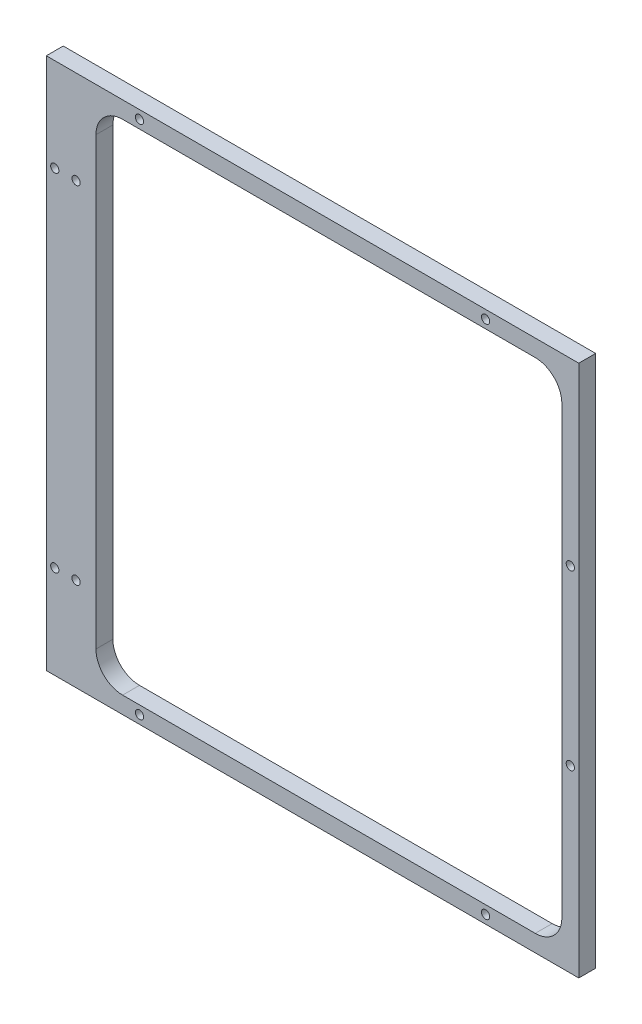
ISO-10303-21;
HEADER;
FILE_DESCRIPTION(('STEP AP214'),'2;1');
FILE_NAME('part.step','',(''),(''),'','','');
FILE_SCHEMA(('AUTOMOTIVE_DESIGN { 1 0 10303 214 1 1 1 1 }'));
ENDSEC;
DATA;
#1=APPLICATION_CONTEXT('core data for automotive mechanical design processes');
#2=APPLICATION_PROTOCOL_DEFINITION('international standard','automotive_design',2000,#1);
#3=PRODUCT_CONTEXT('',#1,'mechanical');
#4=PRODUCT('Part','Part','',(#3));
#5=PRODUCT_RELATED_PRODUCT_CATEGORY('part','',(#4));
#6=PRODUCT_DEFINITION_FORMATION('','',#4);
#7=PRODUCT_DEFINITION_CONTEXT('part definition',#1,'design');
#8=PRODUCT_DEFINITION('design','',#6,#7);
#9=PRODUCT_DEFINITION_SHAPE('','',#8);
#10=(LENGTH_UNIT() NAMED_UNIT(*) SI_UNIT(.MILLI.,.METRE.));
#11=(NAMED_UNIT(*) PLANE_ANGLE_UNIT() SI_UNIT($,.RADIAN.));
#12=(NAMED_UNIT(*) SI_UNIT($,.STERADIAN.) SOLID_ANGLE_UNIT());
#13=UNCERTAINTY_MEASURE_WITH_UNIT(LENGTH_MEASURE(1.E-05),#10,'distance_accuracy_value','');
#14=(GEOMETRIC_REPRESENTATION_CONTEXT(3) GLOBAL_UNCERTAINTY_ASSIGNED_CONTEXT((#13)) GLOBAL_UNIT_ASSIGNED_CONTEXT((#10,
#11,#12)) REPRESENTATION_CONTEXT('',''));
#15=CARTESIAN_POINT('',(0.,0.,0.));
#16=DIRECTION('',(0.,0.,1.));
#17=DIRECTION('',(1.,0.,0.));
#18=AXIS2_PLACEMENT_3D('',#15,#16,#17);
#19=CARTESIAN_POINT('',(100.,-100.,6.35));
#20=DIRECTION('',(-1.,0.,0.));
#21=DIRECTION('',(0.,0.,1.));
#22=AXIS2_PLACEMENT_3D('',#19,#20,#21);
#23=PLANE('',#22);
#24=DIRECTION('',(0.,1.,0.));
#25=VECTOR('',#24,1.);
#26=CARTESIAN_POINT('',(100.,-100.,0.));
#27=LINE('',#26,#25);
#28=CARTESIAN_POINT('',(100.,-100.,0.));
#29=VERTEX_POINT('',#28);
#30=CARTESIAN_POINT('',(100.,100.,0.));
#31=VERTEX_POINT('',#30);
#32=EDGE_CURVE('E184',#29,#31,#27,.T.);
#33=ORIENTED_EDGE('',*,*,#32,.T.);
#34=DIRECTION('',(0.,0.,-1.));
#35=VECTOR('',#34,1.);
#36=CARTESIAN_POINT('',(100.,100.,6.35));
#37=LINE('',#36,#35);
#38=CARTESIAN_POINT('',(100.,100.,6.35));
#39=VERTEX_POINT('',#38);
#40=EDGE_CURVE('E11',#39,#31,#37,.T.);
#41=ORIENTED_EDGE('',*,*,#40,.F.);
#42=DIRECTION('',(0.,1.,0.));
#43=VECTOR('',#42,1.);
#44=CARTESIAN_POINT('',(100.,-100.,6.35));
#45=LINE('',#44,#43);
#46=CARTESIAN_POINT('',(100.,-100.,6.35));
#47=VERTEX_POINT('',#46);
#48=EDGE_CURVE('E196',#47,#39,#45,.T.);
#49=ORIENTED_EDGE('',*,*,#48,.F.);
#50=DIRECTION('',(0.,0.,-1.));
#51=VECTOR('',#50,1.);
#52=CARTESIAN_POINT('',(100.,-100.,6.35));
#53=LINE('',#52,#51);
#54=EDGE_CURVE('E206',#47,#29,#53,.T.);
#55=ORIENTED_EDGE('',*,*,#54,.T.);
#56=EDGE_LOOP('',(#33,#41,#49,#55));
#57=FACE_BOUND('',#56,.T.);
#58=ADVANCED_FACE('F36',(#57),#23,.F.);
#59=CARTESIAN_POINT('',(-100.,100.,6.35));
#60=DIRECTION('',(0.,-1.,0.));
#61=DIRECTION('',(0.,0.,-1.));
#62=AXIS2_PLACEMENT_3D('',#59,#60,#61);
#63=PLANE('',#62);
#64=DIRECTION('',(-1.,0.,0.));
#65=VECTOR('',#64,1.);
#66=CARTESIAN_POINT('',(-100.,100.,0.));
#67=LINE('',#66,#65);
#68=CARTESIAN_POINT('',(-100.,100.,0.));
#69=VERTEX_POINT('',#68);
#70=EDGE_CURVE('E209',#31,#69,#67,.T.);
#71=ORIENTED_EDGE('',*,*,#70,.T.);
#72=DIRECTION('',(0.,0.,-1.));
#73=VECTOR('',#72,1.);
#74=CARTESIAN_POINT('',(-100.,100.,6.35));
#75=LINE('',#74,#73);
#76=CARTESIAN_POINT('',(-100.,100.,6.35));
#77=VERTEX_POINT('',#76);
#78=EDGE_CURVE('E43',#77,#69,#75,.T.);
#79=ORIENTED_EDGE('',*,*,#78,.F.);
#80=DIRECTION('',(-1.,0.,0.));
#81=VECTOR('',#80,1.);
#82=CARTESIAN_POINT('',(-100.,100.,6.35));
#83=LINE('',#82,#81);
#84=EDGE_CURVE('E199',#39,#77,#83,.T.);
#85=ORIENTED_EDGE('',*,*,#84,.F.);
#86=ORIENTED_EDGE('',*,*,#40,.T.);
#87=EDGE_LOOP('',(#71,#79,#85,#86));
#88=FACE_BOUND('',#87,.T.);
#89=ADVANCED_FACE('F237',(#88),#63,.F.);
#90=CARTESIAN_POINT('',(-100.,-100.,6.35));
#91=DIRECTION('',(1.,0.,0.));
#92=DIRECTION('',(0.,0.,-1.));
#93=AXIS2_PLACEMENT_3D('',#90,#91,#92);
#94=PLANE('',#93);
#95=DIRECTION('',(0.,-1.,0.));
#96=VECTOR('',#95,1.);
#97=CARTESIAN_POINT('',(-100.,-100.,0.));
#98=LINE('',#97,#96);
#99=CARTESIAN_POINT('',(-100.,-100.,0.));
#100=VERTEX_POINT('',#99);
#101=EDGE_CURVE('E211',#69,#100,#98,.T.);
#102=ORIENTED_EDGE('',*,*,#101,.T.);
#103=DIRECTION('',(0.,0.,-1.));
#104=VECTOR('',#103,1.);
#105=CARTESIAN_POINT('',(-100.,-100.,6.35));
#106=LINE('',#105,#104);
#107=CARTESIAN_POINT('',(-100.,-100.,6.35));
#108=VERTEX_POINT('',#107);
#109=EDGE_CURVE('E216',#108,#100,#106,.T.);
#110=ORIENTED_EDGE('',*,*,#109,.F.);
#111=DIRECTION('',(0.,-1.,0.));
#112=VECTOR('',#111,1.);
#113=CARTESIAN_POINT('',(-100.,-100.,6.35));
#114=LINE('',#113,#112);
#115=EDGE_CURVE('E202',#77,#108,#114,.T.);
#116=ORIENTED_EDGE('',*,*,#115,.F.);
#117=ORIENTED_EDGE('',*,*,#78,.T.);
#118=EDGE_LOOP('',(#102,#110,#116,#117));
#119=FACE_BOUND('',#118,.T.);
#120=ADVANCED_FACE('F223',(#119),#94,.F.);
#121=CARTESIAN_POINT('',(-100.,-100.,6.35));
#122=DIRECTION('',(0.,1.,0.));
#123=DIRECTION('',(0.,0.,1.));
#124=AXIS2_PLACEMENT_3D('',#121,#122,#123);
#125=PLANE('',#124);
#126=DIRECTION('',(1.,0.,0.));
#127=VECTOR('',#126,1.);
#128=CARTESIAN_POINT('',(-100.,-100.,0.));
#129=LINE('',#128,#127);
#130=EDGE_CURVE('E200',#100,#29,#129,.T.);
#131=ORIENTED_EDGE('',*,*,#130,.T.);
#132=ORIENTED_EDGE('',*,*,#54,.F.);
#133=DIRECTION('',(1.,0.,0.));
#134=VECTOR('',#133,1.);
#135=CARTESIAN_POINT('',(-100.,-100.,6.35));
#136=LINE('',#135,#134);
#137=EDGE_CURVE('E204',#108,#47,#136,.T.);
#138=ORIENTED_EDGE('',*,*,#137,.F.);
#139=ORIENTED_EDGE('',*,*,#109,.T.);
#140=EDGE_LOOP('',(#131,#132,#138,#139));
#141=FACE_BOUND('',#140,.T.);
#142=ADVANCED_FACE('F230',(#141),#125,.F.);
#143=CARTESIAN_POINT('',(0.,0.,6.35));
#144=DIRECTION('',(0.,0.,-1.));
#145=DIRECTION('',(-1.,0.,0.));
#146=AXIS2_PLACEMENT_3D('',#143,#144,#145);
#147=PLANE('',#146);
#148=CARTESIAN_POINT('',(96.825,-32.5,6.35));
#149=DIRECTION('',(0.,0.,1.));
#150=DIRECTION('',(-1.,0.,0.));
#151=AXIS2_PLACEMENT_3D('',#148,#149,#150);
#152=CIRCLE('',#151,1.54999999999999);
#153=CARTESIAN_POINT('',(95.275,-32.5,6.35));
#154=VERTEX_POINT('',#153);
#155=EDGE_CURVE('E345',#154,#154,#152,.T.);
#156=ORIENTED_EDGE('',*,*,#155,.F.);
#157=EDGE_LOOP('',(#156));
#158=FACE_BOUND('',#157,.T.);
#159=CARTESIAN_POINT('',(-96.825,-65.,6.35));
#160=DIRECTION('',(0.,0.,1.));
#161=DIRECTION('',(1.,0.,0.));
#162=AXIS2_PLACEMENT_3D('',#159,#160,#161);
#163=CIRCLE('',#162,1.54999999999999);
#164=CARTESIAN_POINT('',(-95.275,-65.,6.35));
#165=VERTEX_POINT('',#164);
#166=EDGE_CURVE('E341',#165,#165,#163,.T.);
#167=ORIENTED_EDGE('',*,*,#166,.F.);
#168=EDGE_LOOP('',(#167));
#169=FACE_BOUND('',#168,.T.);
#170=CARTESIAN_POINT('',(-88.8249999999999,-65.,6.35));
#171=DIRECTION('',(0.,0.,1.));
#172=DIRECTION('',(-1.,0.,0.));
#173=AXIS2_PLACEMENT_3D('',#170,#171,#172);
#174=CIRCLE('',#173,1.54999999999999);
#175=CARTESIAN_POINT('',(-90.3749999999999,-65.,6.35));
#176=VERTEX_POINT('',#175);
#177=EDGE_CURVE('E336',#176,#176,#174,.T.);
#178=ORIENTED_EDGE('',*,*,#177,.F.);
#179=EDGE_LOOP('',(#178));
#180=FACE_BOUND('',#179,.T.);
#181=CARTESIAN_POINT('',(-96.825,65.,6.35));
#182=DIRECTION('',(0.,0.,1.));
#183=DIRECTION('',(-1.,0.,0.));
#184=AXIS2_PLACEMENT_3D('',#181,#182,#183);
#185=CIRCLE('',#184,1.54999999999999);
#186=CARTESIAN_POINT('',(-98.375,65.,6.35));
#187=VERTEX_POINT('',#186);
#188=EDGE_CURVE('E329',#187,#187,#185,.T.);
#189=ORIENTED_EDGE('',*,*,#188,.F.);
#190=EDGE_LOOP('',(#189));
#191=FACE_BOUND('',#190,.T.);
#192=CARTESIAN_POINT('',(65.,-96.825,6.35));
#193=DIRECTION('',(0.,0.,1.));
#194=DIRECTION('',(-1.,0.,0.));
#195=AXIS2_PLACEMENT_3D('',#192,#193,#194);
#196=CIRCLE('',#195,1.54999999999999);
#197=CARTESIAN_POINT('',(63.45,-96.825,6.35));
#198=VERTEX_POINT('',#197);
#199=EDGE_CURVE('E369',#198,#198,#196,.T.);
#200=ORIENTED_EDGE('',*,*,#199,.F.);
#201=EDGE_LOOP('',(#200));
#202=FACE_BOUND('',#201,.T.);
#203=CARTESIAN_POINT('',(65.,96.825,6.35));
#204=DIRECTION('',(0.,0.,1.));
#205=DIRECTION('',(1.,0.,0.));
#206=AXIS2_PLACEMENT_3D('',#203,#204,#205);
#207=CIRCLE('',#206,1.54999999999999);
#208=CARTESIAN_POINT('',(66.55,96.825,6.35));
#209=VERTEX_POINT('',#208);
#210=EDGE_CURVE('E364',#209,#209,#207,.T.);
#211=ORIENTED_EDGE('',*,*,#210,.F.);
#212=EDGE_LOOP('',(#211));
#213=FACE_BOUND('',#212,.T.);
#214=CARTESIAN_POINT('',(-65.,96.825,6.35));
#215=DIRECTION('',(0.,0.,1.));
#216=DIRECTION('',(-1.,0.,0.));
#217=AXIS2_PLACEMENT_3D('',#214,#215,#216);
#218=CIRCLE('',#217,1.54999999999999);
#219=CARTESIAN_POINT('',(-66.55,96.825,6.35));
#220=VERTEX_POINT('',#219);
#221=EDGE_CURVE('E357',#220,#220,#218,.T.);
#222=ORIENTED_EDGE('',*,*,#221,.F.);
#223=EDGE_LOOP('',(#222));
#224=FACE_BOUND('',#223,.T.);
#225=CARTESIAN_POINT('',(96.825,32.5,6.35));
#226=DIRECTION('',(0.,0.,1.));
#227=DIRECTION('',(1.,0.,0.));
#228=AXIS2_PLACEMENT_3D('',#225,#226,#227);
#229=CIRCLE('',#228,1.54999999999999);
#230=CARTESIAN_POINT('',(98.375,32.5,6.35));
#231=VERTEX_POINT('',#230);
#232=EDGE_CURVE('E352',#231,#231,#229,.T.);
#233=ORIENTED_EDGE('',*,*,#232,.F.);
#234=EDGE_LOOP('',(#233));
#235=FACE_BOUND('',#234,.T.);
#236=CARTESIAN_POINT('',(-88.8249999999999,65.,6.35));
#237=DIRECTION('',(0.,0.,1.));
#238=DIRECTION('',(1.,0.,0.));
#239=AXIS2_PLACEMENT_3D('',#236,#237,#238);
#240=CIRCLE('',#239,1.54999999999999);
#241=CARTESIAN_POINT('',(-87.2749999999999,65.,6.35));
#242=VERTEX_POINT('',#241);
#243=EDGE_CURVE('E324',#242,#242,#240,.T.);
#244=ORIENTED_EDGE('',*,*,#243,.F.);
#245=EDGE_LOOP('',(#244));
#246=FACE_BOUND('',#245,.T.);
#247=CARTESIAN_POINT('',(-65.,-96.825,6.35));
#248=DIRECTION('',(0.,0.,1.));
#249=DIRECTION('',(1.,0.,0.));
#250=AXIS2_PLACEMENT_3D('',#247,#248,#249);
#251=CIRCLE('',#250,1.54999999999999);
#252=CARTESIAN_POINT('',(-63.45,-96.825,6.35));
#253=VERTEX_POINT('',#252);
#254=EDGE_CURVE('E376',#253,#253,#251,.T.);
#255=ORIENTED_EDGE('',*,*,#254,.F.);
#256=EDGE_LOOP('',(#255));
#257=FACE_BOUND('',#256,.T.);
#258=DIRECTION('',(0.,1.,0.));
#259=VECTOR('',#258,1.);
#260=CARTESIAN_POINT('',(93.65,83.65,6.35));
#261=LINE('',#260,#259);
#262=CARTESIAN_POINT('',(93.65,-83.65,6.35));
#263=VERTEX_POINT('',#262);
#264=CARTESIAN_POINT('',(93.65,83.65,6.35));
#265=VERTEX_POINT('',#264);
#266=EDGE_CURVE('E166',#263,#265,#261,.T.);
#267=ORIENTED_EDGE('',*,*,#266,.F.);
#268=CARTESIAN_POINT('',(83.65,-83.65,6.35));
#269=DIRECTION('',(0.,0.,1.));
#270=DIRECTION('',(-1.,0.,0.));
#271=AXIS2_PLACEMENT_3D('',#268,#269,#270);
#272=CIRCLE('',#271,9.99999999999999);
#273=CARTESIAN_POINT('',(83.65,-93.65,6.35));
#274=VERTEX_POINT('',#273);
#275=EDGE_CURVE('E50',#274,#263,#272,.T.);
#276=ORIENTED_EDGE('',*,*,#275,.F.);
#277=DIRECTION('',(1.,0.,0.));
#278=VECTOR('',#277,1.);
#279=CARTESIAN_POINT('',(83.65,-93.65,6.35));
#280=LINE('',#279,#278);
#281=CARTESIAN_POINT('',(-71.35,-93.65,6.35));
#282=VERTEX_POINT('',#281);
#283=EDGE_CURVE('E143',#282,#274,#280,.T.);
#284=ORIENTED_EDGE('',*,*,#283,.F.);
#285=CARTESIAN_POINT('',(-71.35,-83.65,6.35));
#286=DIRECTION('',(0.,0.,1.));
#287=DIRECTION('',(-1.,0.,0.));
#288=AXIS2_PLACEMENT_3D('',#285,#286,#287);
#289=CIRCLE('',#288,10.);
#290=CARTESIAN_POINT('',(-81.35,-83.65,6.35));
#291=VERTEX_POINT('',#290);
#292=EDGE_CURVE('E146',#291,#282,#289,.T.);
#293=ORIENTED_EDGE('',*,*,#292,.F.);
#294=DIRECTION('',(0.,-1.,0.));
#295=VECTOR('',#294,1.);
#296=CARTESIAN_POINT('',(-81.35,83.65,6.35));
#297=LINE('',#296,#295);
#298=CARTESIAN_POINT('',(-81.35,83.65,6.35));
#299=VERTEX_POINT('',#298);
#300=EDGE_CURVE('E177',#299,#291,#297,.T.);
#301=ORIENTED_EDGE('',*,*,#300,.F.);
#302=CARTESIAN_POINT('',(-71.35,83.65,6.35));
#303=DIRECTION('',(0.,0.,1.));
#304=DIRECTION('',(1.,0.,0.));
#305=AXIS2_PLACEMENT_3D('',#302,#303,#304);
#306=CIRCLE('',#305,10.);
#307=CARTESIAN_POINT('',(-71.35,93.65,6.35));
#308=VERTEX_POINT('',#307);
#309=EDGE_CURVE('E174',#308,#299,#306,.T.);
#310=ORIENTED_EDGE('',*,*,#309,.F.);
#311=DIRECTION('',(-1.,0.,0.));
#312=VECTOR('',#311,1.);
#313=CARTESIAN_POINT('',(83.65,93.65,6.35));
#314=LINE('',#313,#312);
#315=CARTESIAN_POINT('',(83.65,93.65,6.35));
#316=VERTEX_POINT('',#315);
#317=EDGE_CURVE('E171',#316,#308,#314,.T.);
#318=ORIENTED_EDGE('',*,*,#317,.F.);
#319=CARTESIAN_POINT('',(83.65,83.65,6.35));
#320=DIRECTION('',(0.,0.,1.));
#321=DIRECTION('',(-1.,0.,0.));
#322=AXIS2_PLACEMENT_3D('',#319,#320,#321);
#323=CIRCLE('',#322,10.);
#324=EDGE_CURVE('E168',#265,#316,#323,.T.);
#325=ORIENTED_EDGE('',*,*,#324,.F.);
#326=EDGE_LOOP('',(#267,#276,#284,#293,#301,#310,#318,#325));
#327=FACE_BOUND('',#326,.T.);
#328=ORIENTED_EDGE('',*,*,#48,.T.);
#329=ORIENTED_EDGE('',*,*,#84,.T.);
#330=ORIENTED_EDGE('',*,*,#115,.T.);
#331=ORIENTED_EDGE('',*,*,#137,.T.);
#332=EDGE_LOOP('',(#328,#329,#330,#331));
#333=FACE_BOUND('',#332,.T.);
#334=ADVANCED_FACE('F236',(#158,#169,#180,#191,#202,#213,#224,#235,#246,#257,#327,#333),#147,.F.);
#335=CARTESIAN_POINT('',(0.,0.,0.));
#336=DIRECTION('',(0.,0.,-1.));
#337=DIRECTION('',(-1.,0.,0.));
#338=AXIS2_PLACEMENT_3D('',#335,#336,#337);
#339=PLANE('',#338);
#340=CARTESIAN_POINT('',(96.825,-32.5,0.));
#341=DIRECTION('',(0.,0.,-1.));
#342=DIRECTION('',(-1.,0.,0.));
#343=AXIS2_PLACEMENT_3D('',#340,#341,#342);
#344=CIRCLE('',#343,1.54999999999999);
#345=CARTESIAN_POINT('',(95.275,-32.5,0.));
#346=VERTEX_POINT('',#345);
#347=EDGE_CURVE('E348',#346,#346,#344,.F.);
#348=ORIENTED_EDGE('',*,*,#347,.T.);
#349=EDGE_LOOP('',(#348));
#350=FACE_BOUND('',#349,.T.);
#351=CARTESIAN_POINT('',(-96.825,-65.,0.));
#352=DIRECTION('',(0.,0.,-1.));
#353=DIRECTION('',(-1.,0.,0.));
#354=AXIS2_PLACEMENT_3D('',#351,#352,#353);
#355=CIRCLE('',#354,1.54999999999999);
#356=CARTESIAN_POINT('',(-98.375,-65.,0.));
#357=VERTEX_POINT('',#356);
#358=EDGE_CURVE('E349',#357,#357,#355,.F.);
#359=ORIENTED_EDGE('',*,*,#358,.T.);
#360=EDGE_LOOP('',(#359));
#361=FACE_BOUND('',#360,.T.);
#362=CARTESIAN_POINT('',(-88.8249999999999,-65.,0.));
#363=DIRECTION('',(0.,0.,-1.));
#364=DIRECTION('',(-1.,0.,0.));
#365=AXIS2_PLACEMENT_3D('',#362,#363,#364);
#366=CIRCLE('',#365,1.54999999999999);
#367=CARTESIAN_POINT('',(-90.3749999999999,-65.,0.));
#368=VERTEX_POINT('',#367);
#369=EDGE_CURVE('E339',#368,#368,#366,.F.);
#370=ORIENTED_EDGE('',*,*,#369,.T.);
#371=EDGE_LOOP('',(#370));
#372=FACE_BOUND('',#371,.T.);
#373=CARTESIAN_POINT('',(-96.825,65.,0.));
#374=DIRECTION('',(0.,0.,-1.));
#375=DIRECTION('',(-1.,0.,0.));
#376=AXIS2_PLACEMENT_3D('',#373,#374,#375);
#377=CIRCLE('',#376,1.54999999999999);
#378=CARTESIAN_POINT('',(-98.375,65.,0.));
#379=VERTEX_POINT('',#378);
#380=EDGE_CURVE('E332',#379,#379,#377,.F.);
#381=ORIENTED_EDGE('',*,*,#380,.T.);
#382=EDGE_LOOP('',(#381));
#383=FACE_BOUND('',#382,.T.);
#384=CARTESIAN_POINT('',(65.,-96.825,0.));
#385=DIRECTION('',(0.,0.,-1.));
#386=DIRECTION('',(-1.,0.,0.));
#387=AXIS2_PLACEMENT_3D('',#384,#385,#386);
#388=CIRCLE('',#387,1.54999999999999);
#389=CARTESIAN_POINT('',(63.45,-96.825,0.));
#390=VERTEX_POINT('',#389);
#391=EDGE_CURVE('E372',#390,#390,#388,.F.);
#392=ORIENTED_EDGE('',*,*,#391,.T.);
#393=EDGE_LOOP('',(#392));
#394=FACE_BOUND('',#393,.T.);
#395=CARTESIAN_POINT('',(65.,96.825,0.));
#396=DIRECTION('',(0.,0.,-1.));
#397=DIRECTION('',(-1.,0.,0.));
#398=AXIS2_PLACEMENT_3D('',#395,#396,#397);
#399=CIRCLE('',#398,1.54999999999999);
#400=CARTESIAN_POINT('',(63.45,96.825,0.));
#401=VERTEX_POINT('',#400);
#402=EDGE_CURVE('E373',#401,#401,#399,.F.);
#403=ORIENTED_EDGE('',*,*,#402,.T.);
#404=EDGE_LOOP('',(#403));
#405=FACE_BOUND('',#404,.T.);
#406=CARTESIAN_POINT('',(-65.,96.825,0.));
#407=DIRECTION('',(0.,0.,-1.));
#408=DIRECTION('',(-1.,0.,0.));
#409=AXIS2_PLACEMENT_3D('',#406,#407,#408);
#410=CIRCLE('',#409,1.54999999999999);
#411=CARTESIAN_POINT('',(-66.55,96.825,0.));
#412=VERTEX_POINT('',#411);
#413=EDGE_CURVE('E360',#412,#412,#410,.F.);
#414=ORIENTED_EDGE('',*,*,#413,.T.);
#415=EDGE_LOOP('',(#414));
#416=FACE_BOUND('',#415,.T.);
#417=CARTESIAN_POINT('',(96.825,32.5,0.));
#418=DIRECTION('',(0.,0.,-1.));
#419=DIRECTION('',(-1.,0.,0.));
#420=AXIS2_PLACEMENT_3D('',#417,#418,#419);
#421=CIRCLE('',#420,1.54999999999999);
#422=CARTESIAN_POINT('',(95.275,32.5,0.));
#423=VERTEX_POINT('',#422);
#424=EDGE_CURVE('E361',#423,#423,#421,.F.);
#425=ORIENTED_EDGE('',*,*,#424,.T.);
#426=EDGE_LOOP('',(#425));
#427=FACE_BOUND('',#426,.T.);
#428=CARTESIAN_POINT('',(-88.8249999999999,65.,0.));
#429=DIRECTION('',(0.,0.,-1.));
#430=DIRECTION('',(-1.,0.,0.));
#431=AXIS2_PLACEMENT_3D('',#428,#429,#430);
#432=CIRCLE('',#431,1.54999999999999);
#433=CARTESIAN_POINT('',(-90.3749999999999,65.,0.));
#434=VERTEX_POINT('',#433);
#435=EDGE_CURVE('E327',#434,#434,#432,.F.);
#436=ORIENTED_EDGE('',*,*,#435,.T.);
#437=EDGE_LOOP('',(#436));
#438=FACE_BOUND('',#437,.T.);
#439=CARTESIAN_POINT('',(-65.,-96.825,0.));
#440=DIRECTION('',(0.,0.,-1.));
#441=DIRECTION('',(-1.,0.,0.));
#442=AXIS2_PLACEMENT_3D('',#439,#440,#441);
#443=CIRCLE('',#442,1.54999999999999);
#444=CARTESIAN_POINT('',(-66.55,-96.825,0.));
#445=VERTEX_POINT('',#444);
#446=EDGE_CURVE('E149',#445,#445,#443,.F.);
#447=ORIENTED_EDGE('',*,*,#446,.T.);
#448=EDGE_LOOP('',(#447));
#449=FACE_BOUND('',#448,.T.);
#450=CARTESIAN_POINT('',(83.65,-83.65,0.));
#451=DIRECTION('',(0.,0.,1.));
#452=DIRECTION('',(-1.,0.,0.));
#453=AXIS2_PLACEMENT_3D('',#450,#451,#452);
#454=CIRCLE('',#453,9.99999999999999);
#455=CARTESIAN_POINT('',(83.65,-93.65,0.));
#456=VERTEX_POINT('',#455);
#457=CARTESIAN_POINT('',(93.65,-83.65,0.));
#458=VERTEX_POINT('',#457);
#459=EDGE_CURVE('E126',#456,#458,#454,.T.);
#460=ORIENTED_EDGE('',*,*,#459,.T.);
#461=DIRECTION('',(0.,1.,0.));
#462=VECTOR('',#461,1.);
#463=CARTESIAN_POINT('',(93.65,83.65,0.));
#464=LINE('',#463,#462);
#465=CARTESIAN_POINT('',(93.65,83.65,0.));
#466=VERTEX_POINT('',#465);
#467=EDGE_CURVE('E135',#458,#466,#464,.T.);
#468=ORIENTED_EDGE('',*,*,#467,.T.);
#469=CARTESIAN_POINT('',(83.65,83.65,0.));
#470=DIRECTION('',(0.,0.,1.));
#471=DIRECTION('',(-1.,0.,0.));
#472=AXIS2_PLACEMENT_3D('',#469,#470,#471);
#473=CIRCLE('',#472,10.);
#474=CARTESIAN_POINT('',(83.65,93.65,0.));
#475=VERTEX_POINT('',#474);
#476=EDGE_CURVE('E58',#466,#475,#473,.T.);
#477=ORIENTED_EDGE('',*,*,#476,.T.);
#478=DIRECTION('',(-1.,0.,0.));
#479=VECTOR('',#478,1.);
#480=CARTESIAN_POINT('',(83.65,93.65,0.));
#481=LINE('',#480,#479);
#482=CARTESIAN_POINT('',(-71.35,93.65,0.));
#483=VERTEX_POINT('',#482);
#484=EDGE_CURVE('E153',#475,#483,#481,.T.);
#485=ORIENTED_EDGE('',*,*,#484,.T.);
#486=CARTESIAN_POINT('',(-71.35,83.65,0.));
#487=DIRECTION('',(0.,0.,1.));
#488=DIRECTION('',(1.,0.,0.));
#489=AXIS2_PLACEMENT_3D('',#486,#487,#488);
#490=CIRCLE('',#489,10.);
#491=CARTESIAN_POINT('',(-81.35,83.65,0.));
#492=VERTEX_POINT('',#491);
#493=EDGE_CURVE('E156',#483,#492,#490,.T.);
#494=ORIENTED_EDGE('',*,*,#493,.T.);
#495=DIRECTION('',(0.,-1.,0.));
#496=VECTOR('',#495,1.);
#497=CARTESIAN_POINT('',(-81.35,83.65,0.));
#498=LINE('',#497,#496);
#499=CARTESIAN_POINT('',(-81.35,-83.65,0.));
#500=VERTEX_POINT('',#499);
#501=EDGE_CURVE('E159',#492,#500,#498,.T.);
#502=ORIENTED_EDGE('',*,*,#501,.T.);
#503=CARTESIAN_POINT('',(-71.35,-83.65,0.));
#504=DIRECTION('',(0.,0.,1.));
#505=DIRECTION('',(-1.,0.,0.));
#506=AXIS2_PLACEMENT_3D('',#503,#504,#505);
#507=CIRCLE('',#506,10.);
#508=CARTESIAN_POINT('',(-71.35,-93.65,0.));
#509=VERTEX_POINT('',#508);
#510=EDGE_CURVE('E162',#500,#509,#507,.T.);
#511=ORIENTED_EDGE('',*,*,#510,.T.);
#512=DIRECTION('',(1.,0.,0.));
#513=VECTOR('',#512,1.);
#514=CARTESIAN_POINT('',(83.65,-93.65,0.));
#515=LINE('',#514,#513);
#516=EDGE_CURVE('E132',#509,#456,#515,.T.);
#517=ORIENTED_EDGE('',*,*,#516,.T.);
#518=EDGE_LOOP('',(#460,#468,#477,#485,#494,#502,#511,#517));
#519=FACE_BOUND('',#518,.T.);
#520=ORIENTED_EDGE('',*,*,#32,.F.);
#521=ORIENTED_EDGE('',*,*,#130,.F.);
#522=ORIENTED_EDGE('',*,*,#101,.F.);
#523=ORIENTED_EDGE('',*,*,#70,.F.);
#524=EDGE_LOOP('',(#520,#521,#522,#523));
#525=FACE_BOUND('',#524,.T.);
#526=ADVANCED_FACE('F139',(#350,#361,#372,#383,#394,#405,#416,#427,#438,#449,#519,#525),#339,.T.);
#527=CARTESIAN_POINT('',(83.65,-83.65,0.));
#528=DIRECTION('',(0.,0.,1.));
#529=DIRECTION('',(1.,0.,0.));
#530=AXIS2_PLACEMENT_3D('',#527,#528,#529);
#531=CYLINDRICAL_SURFACE('',#530,9.99999999999999);
#532=ORIENTED_EDGE('',*,*,#275,.T.);
#533=DIRECTION('',(0.,0.,1.));
#534=VECTOR('',#533,1.);
#535=CARTESIAN_POINT('',(93.65,-83.65,0.));
#536=LINE('',#535,#534);
#537=EDGE_CURVE('E122',#458,#263,#536,.T.);
#538=ORIENTED_EDGE('',*,*,#537,.F.);
#539=ORIENTED_EDGE('',*,*,#459,.F.);
#540=DIRECTION('',(0.,0.,1.));
#541=VECTOR('',#540,1.);
#542=CARTESIAN_POINT('',(83.65,-93.65,0.));
#543=LINE('',#542,#541);
#544=EDGE_CURVE('E182',#456,#274,#543,.T.);
#545=ORIENTED_EDGE('',*,*,#544,.T.);
#546=EDGE_LOOP('',(#532,#538,#539,#545));
#547=FACE_BOUND('',#546,.T.);
#548=ADVANCED_FACE('F124',(#547),#531,.F.);
#549=CARTESIAN_POINT('',(83.65,-93.65,0.));
#550=DIRECTION('',(0.,-1.,0.));
#551=DIRECTION('',(1.,0.,0.));
#552=AXIS2_PLACEMENT_3D('',#549,#550,#551);
#553=PLANE('',#552);
#554=ORIENTED_EDGE('',*,*,#283,.T.);
#555=ORIENTED_EDGE('',*,*,#544,.F.);
#556=ORIENTED_EDGE('',*,*,#516,.F.);
#557=DIRECTION('',(0.,0.,1.));
#558=VECTOR('',#557,1.);
#559=CARTESIAN_POINT('',(-71.35,-93.65,0.));
#560=LINE('',#559,#558);
#561=EDGE_CURVE('E185',#509,#282,#560,.T.);
#562=ORIENTED_EDGE('',*,*,#561,.T.);
#563=EDGE_LOOP('',(#554,#555,#556,#562));
#564=FACE_BOUND('',#563,.T.);
#565=ADVANCED_FACE('F255',(#564),#553,.F.);
#566=CARTESIAN_POINT('',(-71.35,-83.65,0.));
#567=DIRECTION('',(0.,0.,1.));
#568=DIRECTION('',(1.,0.,0.));
#569=AXIS2_PLACEMENT_3D('',#566,#567,#568);
#570=CYLINDRICAL_SURFACE('',#569,10.);
#571=ORIENTED_EDGE('',*,*,#292,.T.);
#572=ORIENTED_EDGE('',*,*,#561,.F.);
#573=ORIENTED_EDGE('',*,*,#510,.F.);
#574=DIRECTION('',(0.,0.,1.));
#575=VECTOR('',#574,1.);
#576=CARTESIAN_POINT('',(-81.35,-83.65,0.));
#577=LINE('',#576,#575);
#578=EDGE_CURVE('E187',#500,#291,#577,.T.);
#579=ORIENTED_EDGE('',*,*,#578,.T.);
#580=EDGE_LOOP('',(#571,#572,#573,#579));
#581=FACE_BOUND('',#580,.T.);
#582=ADVANCED_FACE('F273',(#581),#570,.F.);
#583=CARTESIAN_POINT('',(-81.35,83.65,0.));
#584=DIRECTION('',(-1.,0.,0.));
#585=DIRECTION('',(0.,-1.,0.));
#586=AXIS2_PLACEMENT_3D('',#583,#584,#585);
#587=PLANE('',#586);
#588=ORIENTED_EDGE('',*,*,#300,.T.);
#589=ORIENTED_EDGE('',*,*,#578,.F.);
#590=ORIENTED_EDGE('',*,*,#501,.F.);
#591=DIRECTION('',(0.,0.,1.));
#592=VECTOR('',#591,1.);
#593=CARTESIAN_POINT('',(-81.35,83.65,0.));
#594=LINE('',#593,#592);
#595=EDGE_CURVE('E189',#492,#299,#594,.T.);
#596=ORIENTED_EDGE('',*,*,#595,.T.);
#597=EDGE_LOOP('',(#588,#589,#590,#596));
#598=FACE_BOUND('',#597,.T.);
#599=ADVANCED_FACE('F269',(#598),#587,.F.);
#600=CARTESIAN_POINT('',(-71.35,83.65,0.));
#601=DIRECTION('',(0.,0.,1.));
#602=DIRECTION('',(1.,0.,0.));
#603=AXIS2_PLACEMENT_3D('',#600,#601,#602);
#604=CYLINDRICAL_SURFACE('',#603,10.);
#605=ORIENTED_EDGE('',*,*,#309,.T.);
#606=ORIENTED_EDGE('',*,*,#595,.F.);
#607=ORIENTED_EDGE('',*,*,#493,.F.);
#608=DIRECTION('',(0.,0.,1.));
#609=VECTOR('',#608,1.);
#610=CARTESIAN_POINT('',(-71.35,93.65,0.));
#611=LINE('',#610,#609);
#612=EDGE_CURVE('E191',#483,#308,#611,.T.);
#613=ORIENTED_EDGE('',*,*,#612,.T.);
#614=EDGE_LOOP('',(#605,#606,#607,#613));
#615=FACE_BOUND('',#614,.T.);
#616=ADVANCED_FACE('F265',(#615),#604,.F.);
#617=CARTESIAN_POINT('',(83.65,93.65,0.));
#618=DIRECTION('',(0.,1.,0.));
#619=DIRECTION('',(0.,0.,1.));
#620=AXIS2_PLACEMENT_3D('',#617,#618,#619);
#621=PLANE('',#620);
#622=ORIENTED_EDGE('',*,*,#317,.T.);
#623=ORIENTED_EDGE('',*,*,#612,.F.);
#624=ORIENTED_EDGE('',*,*,#484,.F.);
#625=DIRECTION('',(0.,0.,1.));
#626=VECTOR('',#625,1.);
#627=CARTESIAN_POINT('',(83.65,93.65,0.));
#628=LINE('',#627,#626);
#629=EDGE_CURVE('E193',#475,#316,#628,.T.);
#630=ORIENTED_EDGE('',*,*,#629,.T.);
#631=EDGE_LOOP('',(#622,#623,#624,#630));
#632=FACE_BOUND('',#631,.T.);
#633=ADVANCED_FACE('F262',(#632),#621,.F.);
#634=CARTESIAN_POINT('',(83.65,83.65,0.));
#635=DIRECTION('',(0.,0.,1.));
#636=DIRECTION('',(1.,0.,0.));
#637=AXIS2_PLACEMENT_3D('',#634,#635,#636);
#638=CYLINDRICAL_SURFACE('',#637,10.);
#639=ORIENTED_EDGE('',*,*,#324,.T.);
#640=ORIENTED_EDGE('',*,*,#629,.F.);
#641=ORIENTED_EDGE('',*,*,#476,.F.);
#642=DIRECTION('',(0.,0.,1.));
#643=VECTOR('',#642,1.);
#644=CARTESIAN_POINT('',(93.65,83.65,0.));
#645=LINE('',#644,#643);
#646=EDGE_CURVE('E131',#466,#265,#645,.T.);
#647=ORIENTED_EDGE('',*,*,#646,.T.);
#648=EDGE_LOOP('',(#639,#640,#641,#647));
#649=FACE_BOUND('',#648,.T.);
#650=ADVANCED_FACE('F259',(#649),#638,.F.);
#651=CARTESIAN_POINT('',(93.65,83.65,0.));
#652=DIRECTION('',(1.,0.,0.));
#653=DIRECTION('',(0.,1.,0.));
#654=AXIS2_PLACEMENT_3D('',#651,#652,#653);
#655=PLANE('',#654);
#656=ORIENTED_EDGE('',*,*,#266,.T.);
#657=ORIENTED_EDGE('',*,*,#646,.F.);
#658=ORIENTED_EDGE('',*,*,#467,.F.);
#659=ORIENTED_EDGE('',*,*,#537,.T.);
#660=EDGE_LOOP('',(#656,#657,#658,#659));
#661=FACE_BOUND('',#660,.T.);
#662=ADVANCED_FACE('F136',(#661),#655,.F.);
#663=CARTESIAN_POINT('',(-65.,-96.825,-256.332381879465));
#664=DIRECTION('',(0.,0.,1.));
#665=DIRECTION('',(1.,0.,0.));
#666=AXIS2_PLACEMENT_3D('',#663,#664,#665);
#667=CYLINDRICAL_SURFACE('',#666,1.54999999999999);
#668=ORIENTED_EDGE('',*,*,#254,.T.);
#669=EDGE_LOOP('',(#668));
#670=FACE_BOUND('',#669,.T.);
#671=ORIENTED_EDGE('',*,*,#446,.F.);
#672=EDGE_LOOP('',(#671));
#673=FACE_BOUND('',#672,.T.);
#674=ADVANCED_FACE('F258',(#670,#673),#667,.F.);
#675=CARTESIAN_POINT('',(-88.8249999999999,65.,-256.332381879465));
#676=DIRECTION('',(0.,0.,1.));
#677=DIRECTION('',(1.,0.,0.));
#678=AXIS2_PLACEMENT_3D('',#675,#676,#677);
#679=CYLINDRICAL_SURFACE('',#678,1.54999999999999);
#680=ORIENTED_EDGE('',*,*,#243,.T.);
#681=EDGE_LOOP('',(#680));
#682=FACE_BOUND('',#681,.T.);
#683=ORIENTED_EDGE('',*,*,#435,.F.);
#684=EDGE_LOOP('',(#683));
#685=FACE_BOUND('',#684,.T.);
#686=ADVANCED_FACE('F283',(#682,#685),#679,.F.);
#687=CARTESIAN_POINT('',(96.825,32.5,-256.332381879465));
#688=DIRECTION('',(0.,0.,1.));
#689=DIRECTION('',(1.,0.,0.));
#690=AXIS2_PLACEMENT_3D('',#687,#688,#689);
#691=CYLINDRICAL_SURFACE('',#690,1.54999999999999);
#692=ORIENTED_EDGE('',*,*,#232,.T.);
#693=EDGE_LOOP('',(#692));
#694=FACE_BOUND('',#693,.T.);
#695=ORIENTED_EDGE('',*,*,#424,.F.);
#696=EDGE_LOOP('',(#695));
#697=FACE_BOUND('',#696,.T.);
#698=ADVANCED_FACE('F295',(#694,#697),#691,.F.);
#699=CARTESIAN_POINT('',(-65.,96.825,-256.332381879465));
#700=DIRECTION('',(0.,0.,1.));
#701=DIRECTION('',(1.,0.,0.));
#702=AXIS2_PLACEMENT_3D('',#699,#700,#701);
#703=CYLINDRICAL_SURFACE('',#702,1.54999999999999);
#704=ORIENTED_EDGE('',*,*,#221,.T.);
#705=EDGE_LOOP('',(#704));
#706=FACE_BOUND('',#705,.T.);
#707=ORIENTED_EDGE('',*,*,#413,.F.);
#708=EDGE_LOOP('',(#707));
#709=FACE_BOUND('',#708,.T.);
#710=ADVANCED_FACE('F289',(#706,#709),#703,.F.);
#711=CARTESIAN_POINT('',(65.,96.825,-256.332381879465));
#712=DIRECTION('',(0.,0.,1.));
#713=DIRECTION('',(1.,0.,0.));
#714=AXIS2_PLACEMENT_3D('',#711,#712,#713);
#715=CYLINDRICAL_SURFACE('',#714,1.54999999999999);
#716=ORIENTED_EDGE('',*,*,#210,.T.);
#717=EDGE_LOOP('',(#716));
#718=FACE_BOUND('',#717,.T.);
#719=ORIENTED_EDGE('',*,*,#402,.F.);
#720=EDGE_LOOP('',(#719));
#721=FACE_BOUND('',#720,.T.);
#722=ADVANCED_FACE('F285',(#718,#721),#715,.F.);
#723=CARTESIAN_POINT('',(65.,-96.825,-256.332381879465));
#724=DIRECTION('',(0.,0.,1.));
#725=DIRECTION('',(1.,0.,0.));
#726=AXIS2_PLACEMENT_3D('',#723,#724,#725);
#727=CYLINDRICAL_SURFACE('',#726,1.54999999999999);
#728=ORIENTED_EDGE('',*,*,#199,.T.);
#729=EDGE_LOOP('',(#728));
#730=FACE_BOUND('',#729,.T.);
#731=ORIENTED_EDGE('',*,*,#391,.F.);
#732=EDGE_LOOP('',(#731));
#733=FACE_BOUND('',#732,.T.);
#734=ADVANCED_FACE('F288',(#730,#733),#727,.F.);
#735=CARTESIAN_POINT('',(-96.825,65.,-256.332381879465));
#736=DIRECTION('',(0.,0.,1.));
#737=DIRECTION('',(1.,0.,0.));
#738=AXIS2_PLACEMENT_3D('',#735,#736,#737);
#739=CYLINDRICAL_SURFACE('',#738,1.54999999999999);
#740=ORIENTED_EDGE('',*,*,#188,.T.);
#741=EDGE_LOOP('',(#740));
#742=FACE_BOUND('',#741,.T.);
#743=ORIENTED_EDGE('',*,*,#380,.F.);
#744=EDGE_LOOP('',(#743));
#745=FACE_BOUND('',#744,.T.);
#746=ADVANCED_FACE('F293',(#742,#745),#739,.F.);
#747=CARTESIAN_POINT('',(-88.8249999999999,-65.,-256.332381879465));
#748=DIRECTION('',(0.,0.,1.));
#749=DIRECTION('',(1.,0.,0.));
#750=AXIS2_PLACEMENT_3D('',#747,#748,#749);
#751=CYLINDRICAL_SURFACE('',#750,1.54999999999999);
#752=ORIENTED_EDGE('',*,*,#177,.T.);
#753=EDGE_LOOP('',(#752));
#754=FACE_BOUND('',#753,.T.);
#755=ORIENTED_EDGE('',*,*,#369,.F.);
#756=EDGE_LOOP('',(#755));
#757=FACE_BOUND('',#756,.T.);
#758=ADVANCED_FACE('F306',(#754,#757),#751,.F.);
#759=CARTESIAN_POINT('',(-96.825,-65.,-256.332381879465));
#760=DIRECTION('',(0.,0.,1.));
#761=DIRECTION('',(1.,0.,0.));
#762=AXIS2_PLACEMENT_3D('',#759,#760,#761);
#763=CYLINDRICAL_SURFACE('',#762,1.54999999999999);
#764=ORIENTED_EDGE('',*,*,#166,.T.);
#765=EDGE_LOOP('',(#764));
#766=FACE_BOUND('',#765,.T.);
#767=ORIENTED_EDGE('',*,*,#358,.F.);
#768=EDGE_LOOP('',(#767));
#769=FACE_BOUND('',#768,.T.);
#770=ADVANCED_FACE('F302',(#766,#769),#763,.F.);
#771=CARTESIAN_POINT('',(96.825,-32.5,-256.332381879465));
#772=DIRECTION('',(0.,0.,1.));
#773=DIRECTION('',(1.,0.,0.));
#774=AXIS2_PLACEMENT_3D('',#771,#772,#773);
#775=CYLINDRICAL_SURFACE('',#774,1.54999999999999);
#776=ORIENTED_EDGE('',*,*,#155,.T.);
#777=EDGE_LOOP('',(#776));
#778=FACE_BOUND('',#777,.T.);
#779=ORIENTED_EDGE('',*,*,#347,.F.);
#780=EDGE_LOOP('',(#779));
#781=FACE_BOUND('',#780,.T.);
#782=ADVANCED_FACE('F305',(#778,#781),#775,.F.);
#783=CLOSED_SHELL('',(#58,#89,#120,#142,#334,#526,#548,#565,#582,#599,#616,#633,#650,#662,#674,
#686,#698,#710,#722,#734,#746,#758,#770,#782));
#784=MANIFOLD_SOLID_BREP('B2',#783);
#785=ADVANCED_BREP_SHAPE_REPRESENTATION('',(#18,#784),#14);
#786=SHAPE_DEFINITION_REPRESENTATION(#9,#785);
ENDSEC;
END-ISO-10303-21;
